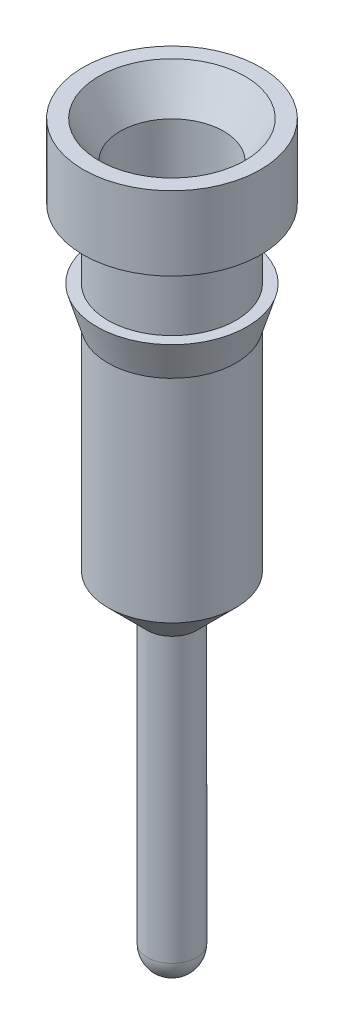
ISO-10303-21;
HEADER;
FILE_DESCRIPTION(('STEP AP214'),'2;1');
FILE_NAME('part.step','',(''),(''),'','','');
FILE_SCHEMA(('AUTOMOTIVE_DESIGN { 1 0 10303 214 1 1 1 1 }'));
ENDSEC;
DATA;
#1=APPLICATION_CONTEXT('core data for automotive mechanical design processes');
#2=APPLICATION_PROTOCOL_DEFINITION('international standard','automotive_design',2000,#1);
#3=PRODUCT_CONTEXT('',#1,'mechanical');
#4=PRODUCT('Part','Part','',(#3));
#5=PRODUCT_RELATED_PRODUCT_CATEGORY('part','',(#4));
#6=PRODUCT_DEFINITION_FORMATION('','',#4);
#7=PRODUCT_DEFINITION_CONTEXT('part definition',#1,'design');
#8=PRODUCT_DEFINITION('design','',#6,#7);
#9=PRODUCT_DEFINITION_SHAPE('','',#8);
#10=(LENGTH_UNIT() NAMED_UNIT(*) SI_UNIT(.MILLI.,.METRE.));
#11=(NAMED_UNIT(*) PLANE_ANGLE_UNIT() SI_UNIT($,.RADIAN.));
#12=(NAMED_UNIT(*) SI_UNIT($,.STERADIAN.) SOLID_ANGLE_UNIT());
#13=UNCERTAINTY_MEASURE_WITH_UNIT(LENGTH_MEASURE(1.E-05),#10,'distance_accuracy_value','');
#14=(GEOMETRIC_REPRESENTATION_CONTEXT(3) GLOBAL_UNCERTAINTY_ASSIGNED_CONTEXT((#13)) GLOBAL_UNIT_ASSIGNED_CONTEXT((#10,
#11,#12)) REPRESENTATION_CONTEXT('',''));
#15=CARTESIAN_POINT('',(0.,0.,0.));
#16=DIRECTION('',(0.,0.,1.));
#17=DIRECTION('',(1.,0.,0.));
#18=AXIS2_PLACEMENT_3D('',#15,#16,#17);
#19=CARTESIAN_POINT('',(0.,0.,0.));
#20=DIRECTION('',(0.,-1.,0.));
#21=DIRECTION('',(0.,0.,-1.));
#22=AXIS2_PLACEMENT_3D('',#19,#20,#21);
#23=PLANE('',#22);
#24=CARTESIAN_POINT('',(0.,0.,0.));
#25=DIRECTION('',(0.,-1.,0.));
#26=DIRECTION('',(0.,0.,-1.));
#27=AXIS2_PLACEMENT_3D('',#24,#25,#26);
#28=CIRCLE('',#27,0.753370452561247);
#29=CARTESIAN_POINT('',(0.,0.,-0.753370452561247));
#30=VERTEX_POINT('',#29);
#31=EDGE_CURVE('E23',#30,#30,#28,.T.);
#32=ORIENTED_EDGE('',*,*,#31,.T.);
#33=EDGE_LOOP('',(#32));
#34=FACE_BOUND('',#33,.T.);
#35=CARTESIAN_POINT('',(0.,0.,0.));
#36=DIRECTION('',(0.,1.,0.));
#37=DIRECTION('',(0.,0.,1.));
#38=AXIS2_PLACEMENT_3D('',#35,#36,#37);
#39=CIRCLE('',#38,0.9144);
#40=CARTESIAN_POINT('',(0.,0.,0.9144));
#41=VERTEX_POINT('',#40);
#42=EDGE_CURVE('E110',#41,#41,#39,.T.);
#43=ORIENTED_EDGE('',*,*,#42,.T.);
#44=EDGE_LOOP('',(#43));
#45=FACE_BOUND('',#44,.T.);
#46=ADVANCED_FACE('F16',(#34,#45),#23,.F.);
#47=CARTESIAN_POINT('',(0.,0.456789294126994,0.));
#48=DIRECTION('',(0.,1.,0.));
#49=DIRECTION('',(0.,0.,1.));
#50=AXIS2_PLACEMENT_3D('',#47,#48,#49);
#51=CYLINDRICAL_SURFACE('',#50,0.9144);
#52=ORIENTED_EDGE('',*,*,#42,.F.);
#53=EDGE_LOOP('',(#52));
#54=FACE_BOUND('',#53,.T.);
#55=CARTESIAN_POINT('',(0.,-0.762,0.));
#56=DIRECTION('',(0.,1.,0.));
#57=DIRECTION('',(0.,0.,1.));
#58=AXIS2_PLACEMENT_3D('',#55,#56,#57);
#59=CIRCLE('',#58,0.9144);
#60=CARTESIAN_POINT('',(0.,-0.762,0.9144));
#61=VERTEX_POINT('',#60);
#62=EDGE_CURVE('E107',#61,#61,#59,.T.);
#63=ORIENTED_EDGE('',*,*,#62,.T.);
#64=EDGE_LOOP('',(#63));
#65=FACE_BOUND('',#64,.T.);
#66=ADVANCED_FACE('F46',(#54,#65),#51,.T.);
#67=CARTESIAN_POINT('',(0.9144,-0.762,0.));
#68=DIRECTION('',(0.,1.,0.));
#69=DIRECTION('',(0.,0.,1.));
#70=AXIS2_PLACEMENT_3D('',#67,#68,#69);
#71=PLANE('',#70);
#72=ORIENTED_EDGE('',*,*,#62,.F.);
#73=EDGE_LOOP('',(#72));
#74=FACE_BOUND('',#73,.T.);
#75=CARTESIAN_POINT('',(0.,-0.762,0.));
#76=DIRECTION('',(0.,1.,0.));
#77=DIRECTION('',(0.,0.,1.));
#78=AXIS2_PLACEMENT_3D('',#75,#76,#77);
#79=CIRCLE('',#78,0.6604);
#80=CARTESIAN_POINT('',(0.,-0.762,0.6604));
#81=VERTEX_POINT('',#80);
#82=EDGE_CURVE('E104',#81,#81,#79,.T.);
#83=ORIENTED_EDGE('',*,*,#82,.T.);
#84=EDGE_LOOP('',(#83));
#85=FACE_BOUND('',#84,.T.);
#86=ADVANCED_FACE('F52',(#74,#85),#71,.F.);
#87=CARTESIAN_POINT('',(0.,0.456789294126994,0.));
#88=DIRECTION('',(0.,1.,0.));
#89=DIRECTION('',(0.,0.,1.));
#90=AXIS2_PLACEMENT_3D('',#87,#88,#89);
#91=CYLINDRICAL_SURFACE('',#90,0.6604);
#92=ORIENTED_EDGE('',*,*,#82,.F.);
#93=EDGE_LOOP('',(#92));
#94=FACE_BOUND('',#93,.T.);
#95=CARTESIAN_POINT('',(0.,-1.4732,0.));
#96=DIRECTION('',(0.,1.,0.));
#97=DIRECTION('',(0.,0.,1.));
#98=AXIS2_PLACEMENT_3D('',#95,#96,#97);
#99=CIRCLE('',#98,0.6604);
#100=CARTESIAN_POINT('',(0.,-1.4732,0.6604));
#101=VERTEX_POINT('',#100);
#102=EDGE_CURVE('E101',#101,#101,#99,.T.);
#103=ORIENTED_EDGE('',*,*,#102,.T.);
#104=EDGE_LOOP('',(#103));
#105=FACE_BOUND('',#104,.T.);
#106=ADVANCED_FACE('F60',(#94,#105),#91,.T.);
#107=CARTESIAN_POINT('',(0.6604,-1.4732,0.));
#108=DIRECTION('',(0.,-1.,0.));
#109=DIRECTION('',(0.,0.,-1.));
#110=AXIS2_PLACEMENT_3D('',#107,#108,#109);
#111=PLANE('',#110);
#112=ORIENTED_EDGE('',*,*,#102,.F.);
#113=EDGE_LOOP('',(#112));
#114=FACE_BOUND('',#113,.T.);
#115=CARTESIAN_POINT('',(0.,-1.4732,0.));
#116=DIRECTION('',(0.,1.,0.));
#117=DIRECTION('',(0.,0.,1.));
#118=AXIS2_PLACEMENT_3D('',#115,#116,#117);
#119=CIRCLE('',#118,0.7747);
#120=CARTESIAN_POINT('',(0.,-1.4732,0.7747));
#121=VERTEX_POINT('',#120);
#122=EDGE_CURVE('E98',#121,#121,#119,.T.);
#123=ORIENTED_EDGE('',*,*,#122,.T.);
#124=EDGE_LOOP('',(#123));
#125=FACE_BOUND('',#124,.T.);
#126=ADVANCED_FACE('F64',(#114,#125),#111,.F.);
#127=CARTESIAN_POINT('',(0.,-1.8542,0.));
#128=DIRECTION('',(0.,1.,0.));
#129=DIRECTION('',(0.,0.,1.));
#130=AXIS2_PLACEMENT_3D('',#127,#128,#129);
#131=CONICAL_SURFACE('',#130,0.6604,0.291456794477867);
#132=ORIENTED_EDGE('',*,*,#122,.F.);
#133=EDGE_LOOP('',(#132));
#134=FACE_BOUND('',#133,.T.);
#135=CARTESIAN_POINT('',(0.,-1.8542,0.));
#136=DIRECTION('',(0.,1.,0.));
#137=DIRECTION('',(0.,0.,1.));
#138=AXIS2_PLACEMENT_3D('',#135,#136,#137);
#139=CIRCLE('',#138,0.6604);
#140=CARTESIAN_POINT('',(0.,-1.8542,0.6604));
#141=VERTEX_POINT('',#140);
#142=EDGE_CURVE('E95',#141,#141,#139,.T.);
#143=ORIENTED_EDGE('',*,*,#142,.T.);
#144=EDGE_LOOP('',(#143));
#145=FACE_BOUND('',#144,.T.);
#146=ADVANCED_FACE('F68',(#134,#145),#131,.T.);
#147=CARTESIAN_POINT('',(0.,0.456789294126994,0.));
#148=DIRECTION('',(0.,1.,0.));
#149=DIRECTION('',(0.,0.,1.));
#150=AXIS2_PLACEMENT_3D('',#147,#148,#149);
#151=CYLINDRICAL_SURFACE('',#150,0.6604);
#152=ORIENTED_EDGE('',*,*,#142,.F.);
#153=EDGE_LOOP('',(#152));
#154=FACE_BOUND('',#153,.T.);
#155=CARTESIAN_POINT('',(0.,-4.0386,0.));
#156=DIRECTION('',(0.,1.,0.));
#157=DIRECTION('',(0.,0.,1.));
#158=AXIS2_PLACEMENT_3D('',#155,#156,#157);
#159=CIRCLE('',#158,0.6604);
#160=CARTESIAN_POINT('',(0.,-4.0386,0.6604));
#161=VERTEX_POINT('',#160);
#162=EDGE_CURVE('E85',#161,#161,#159,.T.);
#163=ORIENTED_EDGE('',*,*,#162,.T.);
#164=EDGE_LOOP('',(#163));
#165=FACE_BOUND('',#164,.T.);
#166=ADVANCED_FACE('F72',(#154,#165),#151,.T.);
#167=CARTESIAN_POINT('',(0.,-4.445,0.));
#168=DIRECTION('',(0.,1.,0.));
#169=DIRECTION('',(0.,0.,1.));
#170=AXIS2_PLACEMENT_3D('',#167,#168,#169);
#171=CONICAL_SURFACE('',#170,0.254,0.785398163397445);
#172=ORIENTED_EDGE('',*,*,#162,.F.);
#173=EDGE_LOOP('',(#172));
#174=FACE_BOUND('',#173,.T.);
#175=CARTESIAN_POINT('',(0.,-4.445,0.));
#176=DIRECTION('',(0.,-1.,0.));
#177=DIRECTION('',(0.,0.,-1.));
#178=AXIS2_PLACEMENT_3D('',#175,#176,#177);
#179=CIRCLE('',#178,0.254);
#180=CARTESIAN_POINT('',(0.,-4.445,-0.254));
#181=VERTEX_POINT('',#180);
#182=EDGE_CURVE('E88',#181,#181,#179,.T.);
#183=ORIENTED_EDGE('',*,*,#182,.F.);
#184=EDGE_LOOP('',(#183));
#185=FACE_BOUND('',#184,.T.);
#186=ADVANCED_FACE('F40',(#174,#185),#171,.T.);
#187=CARTESIAN_POINT('',(0.,-2.7178,0.));
#188=DIRECTION('',(0.,1.,0.));
#189=DIRECTION('',(0.,0.,1.));
#190=AXIS2_PLACEMENT_3D('',#187,#188,#189);
#191=CYLINDRICAL_SURFACE('',#190,0.5334);
#192=CARTESIAN_POINT('',(0.,-0.381000000000002,0.));
#193=DIRECTION('',(0.,-1.,0.));
#194=DIRECTION('',(0.,0.,-1.));
#195=AXIS2_PLACEMENT_3D('',#192,#193,#194);
#196=CIRCLE('',#195,0.5334);
#197=CARTESIAN_POINT('',(0.,-0.381000000000002,-0.5334));
#198=VERTEX_POINT('',#197);
#199=EDGE_CURVE('E113',#198,#198,#196,.F.);
#200=ORIENTED_EDGE('',*,*,#199,.T.);
#201=EDGE_LOOP('',(#200));
#202=FACE_BOUND('',#201,.T.);
#203=CARTESIAN_POINT('',(0.,-2.7178,0.));
#204=DIRECTION('',(0.,1.,0.));
#205=DIRECTION('',(0.,0.,1.));
#206=AXIS2_PLACEMENT_3D('',#203,#204,#205);
#207=CIRCLE('',#206,0.5334);
#208=CARTESIAN_POINT('',(0.,-2.7178,0.5334));
#209=VERTEX_POINT('',#208);
#210=EDGE_CURVE('E90',#209,#209,#207,.T.);
#211=ORIENTED_EDGE('',*,*,#210,.F.);
#212=EDGE_LOOP('',(#211));
#213=FACE_BOUND('',#212,.T.);
#214=ADVANCED_FACE('F29',(#202,#213),#191,.F.);
#215=CARTESIAN_POINT('',(0.,-3.02575863358575,0.));
#216=DIRECTION('',(0.,1.,0.));
#217=DIRECTION('',(0.,0.,1.));
#218=AXIS2_PLACEMENT_3D('',#215,#216,#217);
#219=CONICAL_SURFACE('',#218,0.,1.04719755119659);
#220=ORIENTED_EDGE('',*,*,#210,.T.);
#221=EDGE_LOOP('',(#220));
#222=FACE_BOUND('',#221,.T.);
#223=CARTESIAN_POINT('',(0.,-3.02575863358575,0.));
#224=VERTEX_POINT('',#223);
#225=VERTEX_LOOP('',#224);
#226=FACE_BOUND('',#225,.T.);
#227=ADVANCED_FACE('F26',(#222,#226),#219,.F.);
#228=CARTESIAN_POINT('',(0.,-0.381000000000002,0.));
#229=DIRECTION('',(0.,1.,0.));
#230=DIRECTION('',(0.,0.,1.));
#231=AXIS2_PLACEMENT_3D('',#228,#229,#230);
#232=CONICAL_SURFACE('',#231,0.5334,0.523598775598297);
#233=ORIENTED_EDGE('',*,*,#31,.F.);
#234=EDGE_LOOP('',(#233));
#235=FACE_BOUND('',#234,.T.);
#236=ORIENTED_EDGE('',*,*,#199,.F.);
#237=EDGE_LOOP('',(#236));
#238=FACE_BOUND('',#237,.T.);
#239=ADVANCED_FACE('F28',(#235,#238),#232,.F.);
#240=CARTESIAN_POINT('',(0.,-7.62,0.));
#241=DIRECTION('',(0.,1.,0.));
#242=DIRECTION('',(0.,0.,1.));
#243=AXIS2_PLACEMENT_3D('',#240,#241,#242);
#244=CYLINDRICAL_SURFACE('',#243,0.254);
#245=CARTESIAN_POINT('',(0.,-7.366,0.));
#246=DIRECTION('',(0.,1.,0.));
#247=DIRECTION('',(0.,0.,1.));
#248=AXIS2_PLACEMENT_3D('',#245,#246,#247);
#249=CIRCLE('',#248,0.254);
#250=CARTESIAN_POINT('',(0.,-7.366,0.254));
#251=VERTEX_POINT('',#250);
#252=EDGE_CURVE('E11',#251,#251,#249,.T.);
#253=ORIENTED_EDGE('',*,*,#252,.T.);
#254=EDGE_LOOP('',(#253));
#255=FACE_BOUND('',#254,.T.);
#256=ORIENTED_EDGE('',*,*,#182,.T.);
#257=EDGE_LOOP('',(#256));
#258=FACE_BOUND('',#257,.T.);
#259=ADVANCED_FACE('F38',(#255,#258),#244,.T.);
#260=CARTESIAN_POINT('',(0.,-7.366,0.));
#261=DIRECTION('',(0.,0.,1.));
#262=DIRECTION('',(1.,0.,0.));
#263=AXIS2_PLACEMENT_3D('',#260,#261,#262);
#264=SPHERICAL_SURFACE('',#263,0.254);
#265=CARTESIAN_POINT('',(0.,-7.366,0.));
#266=DIRECTION('',(0.,1.,0.));
#267=DIRECTION('',(0.,0.,1.));
#268=AXIS2_PLACEMENT_3D('',#265,#266,#267);
#269=SPHERICAL_SURFACE('',#268,0.254);
#270=ORIENTED_EDGE('',*,*,#252,.F.);
#271=EDGE_LOOP('',(#270));
#272=FACE_BOUND('',#271,.T.);
#273=ADVANCED_FACE('F18',(#272),#269,.T.);
#274=CLOSED_SHELL('',(#46,#66,#86,#106,#126,#146,#166,#186,#214,#227,#239,#259,#273));
#275=MANIFOLD_SOLID_BREP('B1',#274);
#276=ADVANCED_BREP_SHAPE_REPRESENTATION('',(#18,#275),#14);
#277=SHAPE_DEFINITION_REPRESENTATION(#9,#276);
ENDSEC;
END-ISO-10303-21;
